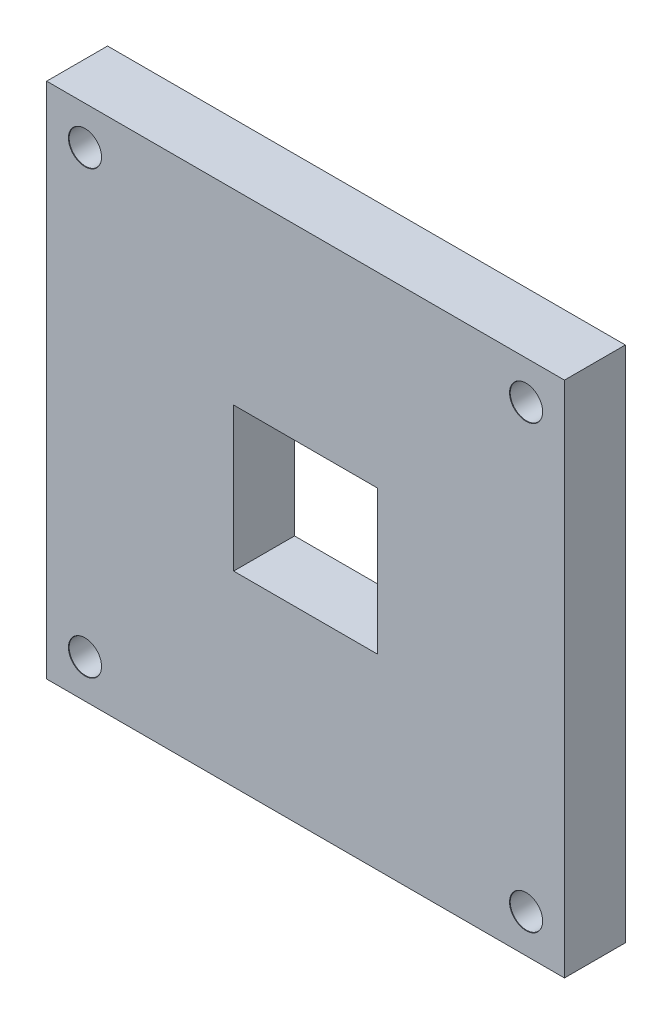
ISO-10303-21;
HEADER;
FILE_DESCRIPTION(('STEP AP214'),'2;1');
FILE_NAME('part.step','',(''),(''),'','','');
FILE_SCHEMA(('AUTOMOTIVE_DESIGN { 1 0 10303 214 1 1 1 1 }'));
ENDSEC;
DATA;
#1=APPLICATION_CONTEXT('core data for automotive mechanical design processes');
#2=APPLICATION_PROTOCOL_DEFINITION('international standard','automotive_design',2000,#1);
#3=PRODUCT_CONTEXT('',#1,'mechanical');
#4=PRODUCT('Part','Part','',(#3));
#5=PRODUCT_RELATED_PRODUCT_CATEGORY('part','',(#4));
#6=PRODUCT_DEFINITION_FORMATION('','',#4);
#7=PRODUCT_DEFINITION_CONTEXT('part definition',#1,'design');
#8=PRODUCT_DEFINITION('design','',#6,#7);
#9=PRODUCT_DEFINITION_SHAPE('','',#8);
#10=(LENGTH_UNIT() NAMED_UNIT(*) SI_UNIT(.MILLI.,.METRE.));
#11=(NAMED_UNIT(*) PLANE_ANGLE_UNIT() SI_UNIT($,.RADIAN.));
#12=(NAMED_UNIT(*) SI_UNIT($,.STERADIAN.) SOLID_ANGLE_UNIT());
#13=UNCERTAINTY_MEASURE_WITH_UNIT(LENGTH_MEASURE(1.E-05),#10,'distance_accuracy_value','');
#14=(GEOMETRIC_REPRESENTATION_CONTEXT(3) GLOBAL_UNCERTAINTY_ASSIGNED_CONTEXT((#13)) GLOBAL_UNIT_ASSIGNED_CONTEXT((#10,
#11,#12)) REPRESENTATION_CONTEXT('',''));
#15=CARTESIAN_POINT('',(0.,0.,0.));
#16=DIRECTION('',(0.,0.,1.));
#17=DIRECTION('',(1.,0.,0.));
#18=AXIS2_PLACEMENT_3D('',#15,#16,#17);
#19=CARTESIAN_POINT('',(-27.,-27.,-6.35));
#20=DIRECTION('',(0.,-1.,0.));
#21=DIRECTION('',(0.,0.,-1.));
#22=AXIS2_PLACEMENT_3D('',#19,#20,#21);
#23=PLANE('',#22);
#24=DIRECTION('',(1.,0.,0.));
#25=VECTOR('',#24,1.);
#26=CARTESIAN_POINT('',(-27.,-27.,0.));
#27=LINE('',#26,#25);
#28=CARTESIAN_POINT('',(-27.,-27.,0.));
#29=VERTEX_POINT('',#28);
#30=CARTESIAN_POINT('',(27.,-27.,0.));
#31=VERTEX_POINT('',#30);
#32=EDGE_CURVE('E186',#29,#31,#27,.T.);
#33=ORIENTED_EDGE('',*,*,#32,.F.);
#34=DIRECTION('',(0.,0.,1.));
#35=VECTOR('',#34,1.);
#36=CARTESIAN_POINT('',(-27.,-27.,-6.35));
#37=LINE('',#36,#35);
#38=CARTESIAN_POINT('',(-27.,-27.,-6.35));
#39=VERTEX_POINT('',#38);
#40=EDGE_CURVE('E11',#39,#29,#37,.T.);
#41=ORIENTED_EDGE('',*,*,#40,.F.);
#42=DIRECTION('',(1.,0.,0.));
#43=VECTOR('',#42,1.);
#44=CARTESIAN_POINT('',(-27.,-27.,-6.35));
#45=LINE('',#44,#43);
#46=CARTESIAN_POINT('',(27.,-27.,-6.35));
#47=VERTEX_POINT('',#46);
#48=EDGE_CURVE('E174',#39,#47,#45,.T.);
#49=ORIENTED_EDGE('',*,*,#48,.T.);
#50=DIRECTION('',(0.,0.,1.));
#51=VECTOR('',#50,1.);
#52=CARTESIAN_POINT('',(27.,-27.,-6.35));
#53=LINE('',#52,#51);
#54=EDGE_CURVE('E185',#47,#31,#53,.T.);
#55=ORIENTED_EDGE('',*,*,#54,.T.);
#56=EDGE_LOOP('',(#33,#41,#49,#55));
#57=FACE_BOUND('',#56,.T.);
#58=ADVANCED_FACE('F45',(#57),#23,.T.);
#59=CARTESIAN_POINT('',(-27.,-27.,-6.35));
#60=DIRECTION('',(1.,0.,0.));
#61=DIRECTION('',(0.,0.,-1.));
#62=AXIS2_PLACEMENT_3D('',#59,#60,#61);
#63=PLANE('',#62);
#64=DIRECTION('',(0.,1.,0.));
#65=VECTOR('',#64,1.);
#66=CARTESIAN_POINT('',(-27.,-27.,0.));
#67=LINE('',#66,#65);
#68=CARTESIAN_POINT('',(-27.,27.,0.));
#69=VERTEX_POINT('',#68);
#70=EDGE_CURVE('E178',#29,#69,#67,.T.);
#71=ORIENTED_EDGE('',*,*,#70,.T.);
#72=DIRECTION('',(0.,0.,1.));
#73=VECTOR('',#72,1.);
#74=CARTESIAN_POINT('',(-27.,27.,-6.35));
#75=LINE('',#74,#73);
#76=CARTESIAN_POINT('',(-27.,27.,-6.35));
#77=VERTEX_POINT('',#76);
#78=EDGE_CURVE('E53',#77,#69,#75,.T.);
#79=ORIENTED_EDGE('',*,*,#78,.F.);
#80=DIRECTION('',(0.,1.,0.));
#81=VECTOR('',#80,1.);
#82=CARTESIAN_POINT('',(-27.,-27.,-6.35));
#83=LINE('',#82,#81);
#84=EDGE_CURVE('E183',#39,#77,#83,.T.);
#85=ORIENTED_EDGE('',*,*,#84,.F.);
#86=ORIENTED_EDGE('',*,*,#40,.T.);
#87=EDGE_LOOP('',(#71,#79,#85,#86));
#88=FACE_BOUND('',#87,.T.);
#89=ADVANCED_FACE('F227',(#88),#63,.F.);
#90=CARTESIAN_POINT('',(-27.,27.,-6.35));
#91=DIRECTION('',(0.,-1.,0.));
#92=DIRECTION('',(0.,0.,-1.));
#93=AXIS2_PLACEMENT_3D('',#90,#91,#92);
#94=PLANE('',#93);
#95=DIRECTION('',(1.,0.,0.));
#96=VECTOR('',#95,1.);
#97=CARTESIAN_POINT('',(-27.,27.,0.));
#98=LINE('',#97,#96);
#99=CARTESIAN_POINT('',(27.,27.,0.));
#100=VERTEX_POINT('',#99);
#101=EDGE_CURVE('E192',#69,#100,#98,.T.);
#102=ORIENTED_EDGE('',*,*,#101,.T.);
#103=DIRECTION('',(0.,0.,1.));
#104=VECTOR('',#103,1.);
#105=CARTESIAN_POINT('',(27.,27.,-6.35));
#106=LINE('',#105,#104);
#107=CARTESIAN_POINT('',(27.,27.,-6.35));
#108=VERTEX_POINT('',#107);
#109=EDGE_CURVE('E198',#108,#100,#106,.T.);
#110=ORIENTED_EDGE('',*,*,#109,.F.);
#111=DIRECTION('',(1.,0.,0.));
#112=VECTOR('',#111,1.);
#113=CARTESIAN_POINT('',(-27.,27.,-6.35));
#114=LINE('',#113,#112);
#115=EDGE_CURVE('E181',#77,#108,#114,.T.);
#116=ORIENTED_EDGE('',*,*,#115,.F.);
#117=ORIENTED_EDGE('',*,*,#78,.T.);
#118=EDGE_LOOP('',(#102,#110,#116,#117));
#119=FACE_BOUND('',#118,.T.);
#120=ADVANCED_FACE('F232',(#119),#94,.F.);
#121=CARTESIAN_POINT('',(27.,-27.,-6.35));
#122=DIRECTION('',(1.,0.,0.));
#123=DIRECTION('',(0.,0.,-1.));
#124=AXIS2_PLACEMENT_3D('',#121,#122,#123);
#125=PLANE('',#124);
#126=DIRECTION('',(0.,1.,0.));
#127=VECTOR('',#126,1.);
#128=CARTESIAN_POINT('',(27.,-27.,0.));
#129=LINE('',#128,#127);
#130=EDGE_CURVE('E189',#31,#100,#129,.T.);
#131=ORIENTED_EDGE('',*,*,#130,.F.);
#132=ORIENTED_EDGE('',*,*,#54,.F.);
#133=DIRECTION('',(0.,1.,0.));
#134=VECTOR('',#133,1.);
#135=CARTESIAN_POINT('',(27.,-27.,-6.35));
#136=LINE('',#135,#134);
#137=EDGE_CURVE('E177',#47,#108,#136,.T.);
#138=ORIENTED_EDGE('',*,*,#137,.T.);
#139=ORIENTED_EDGE('',*,*,#109,.T.);
#140=EDGE_LOOP('',(#131,#132,#138,#139));
#141=FACE_BOUND('',#140,.T.);
#142=ADVANCED_FACE('F249',(#141),#125,.T.);
#143=CARTESIAN_POINT('',(0.,0.,-6.35));
#144=DIRECTION('',(0.,0.,1.));
#145=DIRECTION('',(1.,0.,0.));
#146=AXIS2_PLACEMENT_3D('',#143,#144,#145);
#147=PLANE('',#146);
#148=DIRECTION('',(1.,0.,0.));
#149=VECTOR('',#148,1.);
#150=CARTESIAN_POINT('',(0.,-7.5,-6.35));
#151=LINE('',#150,#149);
#152=CARTESIAN_POINT('',(-7.5,-7.5,-6.35));
#153=VERTEX_POINT('',#152);
#154=CARTESIAN_POINT('',(7.5,-7.5,-6.35));
#155=VERTEX_POINT('',#154);
#156=EDGE_CURVE('E141',#153,#155,#151,.T.);
#157=ORIENTED_EDGE('',*,*,#156,.T.);
#158=DIRECTION('',(0.,1.,0.));
#159=VECTOR('',#158,1.);
#160=CARTESIAN_POINT('',(7.5,0.,-6.35));
#161=LINE('',#160,#159);
#162=CARTESIAN_POINT('',(7.5,7.5,-6.35));
#163=VERTEX_POINT('',#162);
#164=EDGE_CURVE('E144',#155,#163,#161,.T.);
#165=ORIENTED_EDGE('',*,*,#164,.T.);
#166=DIRECTION('',(-1.,0.,0.));
#167=VECTOR('',#166,1.);
#168=CARTESIAN_POINT('',(0.,7.5,-6.35));
#169=LINE('',#168,#167);
#170=CARTESIAN_POINT('',(-7.5,7.5,-6.35));
#171=VERTEX_POINT('',#170);
#172=EDGE_CURVE('E136',#163,#171,#169,.T.);
#173=ORIENTED_EDGE('',*,*,#172,.T.);
#174=DIRECTION('',(0.,-1.,0.));
#175=VECTOR('',#174,1.);
#176=CARTESIAN_POINT('',(-7.5,0.,-6.35));
#177=LINE('',#176,#175);
#178=EDGE_CURVE('E116',#171,#153,#177,.T.);
#179=ORIENTED_EDGE('',*,*,#178,.T.);
#180=EDGE_LOOP('',(#157,#165,#173,#179));
#181=FACE_BOUND('',#180,.T.);
#182=CARTESIAN_POINT('',(23.,23.,-6.35));
#183=DIRECTION('',(0.,0.,1.));
#184=DIRECTION('',(1.,0.,0.));
#185=AXIS2_PLACEMENT_3D('',#182,#183,#184);
#186=CIRCLE('',#185,1.7);
#187=CARTESIAN_POINT('',(24.7,23.,-6.35));
#188=VERTEX_POINT('',#187);
#189=EDGE_CURVE('E48',#188,#188,#186,.T.);
#190=ORIENTED_EDGE('',*,*,#189,.T.);
#191=EDGE_LOOP('',(#190));
#192=FACE_BOUND('',#191,.T.);
#193=CARTESIAN_POINT('',(-23.,-23.,-6.35));
#194=DIRECTION('',(0.,0.,1.));
#195=DIRECTION('',(1.,0.,0.));
#196=AXIS2_PLACEMENT_3D('',#193,#194,#195);
#197=CIRCLE('',#196,1.7);
#198=CARTESIAN_POINT('',(-21.3,-23.,-6.35));
#199=VERTEX_POINT('',#198);
#200=EDGE_CURVE('E159',#199,#199,#197,.T.);
#201=ORIENTED_EDGE('',*,*,#200,.T.);
#202=EDGE_LOOP('',(#201));
#203=FACE_BOUND('',#202,.T.);
#204=CARTESIAN_POINT('',(-23.,23.,-6.35));
#205=DIRECTION('',(0.,0.,1.));
#206=DIRECTION('',(1.,0.,0.));
#207=AXIS2_PLACEMENT_3D('',#204,#205,#206);
#208=CIRCLE('',#207,1.7);
#209=CARTESIAN_POINT('',(-21.3,23.,-6.35));
#210=VERTEX_POINT('',#209);
#211=EDGE_CURVE('E166',#210,#210,#208,.T.);
#212=ORIENTED_EDGE('',*,*,#211,.T.);
#213=EDGE_LOOP('',(#212));
#214=FACE_BOUND('',#213,.T.);
#215=CARTESIAN_POINT('',(23.,-23.,-6.35));
#216=DIRECTION('',(0.,0.,1.));
#217=DIRECTION('',(1.,0.,0.));
#218=AXIS2_PLACEMENT_3D('',#215,#216,#217);
#219=CIRCLE('',#218,1.7);
#220=CARTESIAN_POINT('',(24.7,-23.,-6.35));
#221=VERTEX_POINT('',#220);
#222=EDGE_CURVE('E173',#221,#221,#219,.T.);
#223=ORIENTED_EDGE('',*,*,#222,.T.);
#224=EDGE_LOOP('',(#223));
#225=FACE_BOUND('',#224,.T.);
#226=ORIENTED_EDGE('',*,*,#48,.F.);
#227=ORIENTED_EDGE('',*,*,#84,.T.);
#228=ORIENTED_EDGE('',*,*,#115,.T.);
#229=ORIENTED_EDGE('',*,*,#137,.F.);
#230=EDGE_LOOP('',(#226,#227,#228,#229));
#231=FACE_BOUND('',#230,.T.);
#232=ADVANCED_FACE('F207',(#181,#192,#203,#214,#225,#231),#147,.F.);
#233=CARTESIAN_POINT('',(0.,0.,0.));
#234=DIRECTION('',(0.,0.,1.));
#235=DIRECTION('',(1.,0.,0.));
#236=AXIS2_PLACEMENT_3D('',#233,#234,#235);
#237=PLANE('',#236);
#238=DIRECTION('',(0.,1.,0.));
#239=VECTOR('',#238,1.);
#240=CARTESIAN_POINT('',(7.5,7.5,0.));
#241=LINE('',#240,#239);
#242=CARTESIAN_POINT('',(7.5,-7.5,0.));
#243=VERTEX_POINT('',#242);
#244=CARTESIAN_POINT('',(7.5,7.5,0.));
#245=VERTEX_POINT('',#244);
#246=EDGE_CURVE('E69',#243,#245,#241,.T.);
#247=ORIENTED_EDGE('',*,*,#246,.F.);
#248=DIRECTION('',(1.,0.,0.));
#249=VECTOR('',#248,1.);
#250=CARTESIAN_POINT('',(-7.5,-7.5,0.));
#251=LINE('',#250,#249);
#252=CARTESIAN_POINT('',(-7.5,-7.5,0.));
#253=VERTEX_POINT('',#252);
#254=EDGE_CURVE('E129',#253,#243,#251,.T.);
#255=ORIENTED_EDGE('',*,*,#254,.F.);
#256=DIRECTION('',(0.,-1.,0.));
#257=VECTOR('',#256,1.);
#258=CARTESIAN_POINT('',(-7.5,7.5,0.));
#259=LINE('',#258,#257);
#260=CARTESIAN_POINT('',(-7.5,7.5,0.));
#261=VERTEX_POINT('',#260);
#262=EDGE_CURVE('E113',#261,#253,#259,.T.);
#263=ORIENTED_EDGE('',*,*,#262,.F.);
#264=DIRECTION('',(-1.,0.,0.));
#265=VECTOR('',#264,1.);
#266=CARTESIAN_POINT('',(-7.5,7.5,0.));
#267=LINE('',#266,#265);
#268=EDGE_CURVE('E122',#245,#261,#267,.T.);
#269=ORIENTED_EDGE('',*,*,#268,.F.);
#270=EDGE_LOOP('',(#247,#255,#263,#269));
#271=FACE_BOUND('',#270,.T.);
#272=CARTESIAN_POINT('',(23.,23.,0.));
#273=DIRECTION('',(0.,0.,1.));
#274=DIRECTION('',(1.,0.,0.));
#275=AXIS2_PLACEMENT_3D('',#272,#273,#274);
#276=CIRCLE('',#275,1.725);
#277=CARTESIAN_POINT('',(24.725,23.,0.));
#278=VERTEX_POINT('',#277);
#279=EDGE_CURVE('E147',#278,#278,#276,.T.);
#280=ORIENTED_EDGE('',*,*,#279,.F.);
#281=EDGE_LOOP('',(#280));
#282=FACE_BOUND('',#281,.T.);
#283=CARTESIAN_POINT('',(-23.,-23.,0.));
#284=DIRECTION('',(0.,0.,1.));
#285=DIRECTION('',(1.,0.,0.));
#286=AXIS2_PLACEMENT_3D('',#283,#284,#285);
#287=CIRCLE('',#286,1.725);
#288=CARTESIAN_POINT('',(-21.275,-23.,0.));
#289=VERTEX_POINT('',#288);
#290=EDGE_CURVE('E153',#289,#289,#287,.T.);
#291=ORIENTED_EDGE('',*,*,#290,.F.);
#292=EDGE_LOOP('',(#291));
#293=FACE_BOUND('',#292,.T.);
#294=CARTESIAN_POINT('',(-23.,23.,0.));
#295=DIRECTION('',(0.,0.,1.));
#296=DIRECTION('',(1.,0.,0.));
#297=AXIS2_PLACEMENT_3D('',#294,#295,#296);
#298=CIRCLE('',#297,1.725);
#299=CARTESIAN_POINT('',(-21.275,23.,0.));
#300=VERTEX_POINT('',#299);
#301=EDGE_CURVE('E160',#300,#300,#298,.T.);
#302=ORIENTED_EDGE('',*,*,#301,.F.);
#303=EDGE_LOOP('',(#302));
#304=FACE_BOUND('',#303,.T.);
#305=CARTESIAN_POINT('',(23.,-23.,0.));
#306=DIRECTION('',(0.,0.,1.));
#307=DIRECTION('',(1.,0.,0.));
#308=AXIS2_PLACEMENT_3D('',#305,#306,#307);
#309=CIRCLE('',#308,1.725);
#310=CARTESIAN_POINT('',(24.725,-23.,0.));
#311=VERTEX_POINT('',#310);
#312=EDGE_CURVE('E167',#311,#311,#309,.T.);
#313=ORIENTED_EDGE('',*,*,#312,.F.);
#314=EDGE_LOOP('',(#313));
#315=FACE_BOUND('',#314,.T.);
#316=ORIENTED_EDGE('',*,*,#32,.T.);
#317=ORIENTED_EDGE('',*,*,#130,.T.);
#318=ORIENTED_EDGE('',*,*,#101,.F.);
#319=ORIENTED_EDGE('',*,*,#70,.F.);
#320=EDGE_LOOP('',(#316,#317,#318,#319));
#321=FACE_BOUND('',#320,.T.);
#322=ADVANCED_FACE('F126',(#271,#282,#293,#304,#315,#321),#237,.T.);
#323=CARTESIAN_POINT('',(23.,-23.,0.));
#324=DIRECTION('',(0.,0.,1.));
#325=DIRECTION('',(1.,0.,0.));
#326=AXIS2_PLACEMENT_3D('',#323,#324,#325);
#327=CYLINDRICAL_SURFACE('',#326,1.7);
#328=CARTESIAN_POINT('',(23.,-23.,-0.0433012701892242));
#329=DIRECTION('',(0.,0.,1.));
#330=DIRECTION('',(1.,0.,0.));
#331=AXIS2_PLACEMENT_3D('',#328,#329,#330);
#332=CIRCLE('',#331,1.7);
#333=CARTESIAN_POINT('',(24.7,-23.,-0.0433012701892242));
#334=VERTEX_POINT('',#333);
#335=EDGE_CURVE('E170',#334,#334,#332,.T.);
#336=ORIENTED_EDGE('',*,*,#335,.T.);
#337=EDGE_LOOP('',(#336));
#338=FACE_BOUND('',#337,.T.);
#339=ORIENTED_EDGE('',*,*,#222,.F.);
#340=EDGE_LOOP('',(#339));
#341=FACE_BOUND('',#340,.T.);
#342=ADVANCED_FACE('F261',(#338,#341),#327,.F.);
#343=CARTESIAN_POINT('',(23.,-23.,0.));
#344=DIRECTION('',(0.,0.,1.));
#345=DIRECTION('',(1.,0.,0.));
#346=AXIS2_PLACEMENT_3D('',#343,#344,#345);
#347=CONICAL_SURFACE('',#346,1.725,0.523598775598288);
#348=ORIENTED_EDGE('',*,*,#335,.F.);
#349=EDGE_LOOP('',(#348));
#350=FACE_BOUND('',#349,.T.);
#351=ORIENTED_EDGE('',*,*,#312,.T.);
#352=EDGE_LOOP('',(#351));
#353=FACE_BOUND('',#352,.T.);
#354=ADVANCED_FACE('F264',(#350,#353),#347,.F.);
#355=CARTESIAN_POINT('',(-23.,23.,0.));
#356=DIRECTION('',(0.,0.,1.));
#357=DIRECTION('',(1.,0.,0.));
#358=AXIS2_PLACEMENT_3D('',#355,#356,#357);
#359=CYLINDRICAL_SURFACE('',#358,1.7);
#360=CARTESIAN_POINT('',(-23.,23.,-0.0433012701892242));
#361=DIRECTION('',(0.,0.,1.));
#362=DIRECTION('',(1.,0.,0.));
#363=AXIS2_PLACEMENT_3D('',#360,#361,#362);
#364=CIRCLE('',#363,1.7);
#365=CARTESIAN_POINT('',(-21.3,23.,-0.0433012701892242));
#366=VERTEX_POINT('',#365);
#367=EDGE_CURVE('E163',#366,#366,#364,.T.);
#368=ORIENTED_EDGE('',*,*,#367,.T.);
#369=EDGE_LOOP('',(#368));
#370=FACE_BOUND('',#369,.T.);
#371=ORIENTED_EDGE('',*,*,#211,.F.);
#372=EDGE_LOOP('',(#371));
#373=FACE_BOUND('',#372,.T.);
#374=ADVANCED_FACE('F223',(#370,#373),#359,.F.);
#375=CARTESIAN_POINT('',(-23.,23.,0.));
#376=DIRECTION('',(0.,0.,1.));
#377=DIRECTION('',(1.,0.,0.));
#378=AXIS2_PLACEMENT_3D('',#375,#376,#377);
#379=CONICAL_SURFACE('',#378,1.725,0.523598775598288);
#380=ORIENTED_EDGE('',*,*,#367,.F.);
#381=EDGE_LOOP('',(#380));
#382=FACE_BOUND('',#381,.T.);
#383=ORIENTED_EDGE('',*,*,#301,.T.);
#384=EDGE_LOOP('',(#383));
#385=FACE_BOUND('',#384,.T.);
#386=ADVANCED_FACE('F213',(#382,#385),#379,.F.);
#387=CARTESIAN_POINT('',(-23.,-23.,0.));
#388=DIRECTION('',(0.,0.,1.));
#389=DIRECTION('',(1.,0.,0.));
#390=AXIS2_PLACEMENT_3D('',#387,#388,#389);
#391=CYLINDRICAL_SURFACE('',#390,1.7);
#392=CARTESIAN_POINT('',(-23.,-23.,-0.0433012701892242));
#393=DIRECTION('',(0.,0.,1.));
#394=DIRECTION('',(1.,0.,0.));
#395=AXIS2_PLACEMENT_3D('',#392,#393,#394);
#396=CIRCLE('',#395,1.7);
#397=CARTESIAN_POINT('',(-21.3,-23.,-0.0433012701892242));
#398=VERTEX_POINT('',#397);
#399=EDGE_CURVE('E156',#398,#398,#396,.T.);
#400=ORIENTED_EDGE('',*,*,#399,.T.);
#401=EDGE_LOOP('',(#400));
#402=FACE_BOUND('',#401,.T.);
#403=ORIENTED_EDGE('',*,*,#200,.F.);
#404=EDGE_LOOP('',(#403));
#405=FACE_BOUND('',#404,.T.);
#406=ADVANCED_FACE('F210',(#402,#405),#391,.F.);
#407=CARTESIAN_POINT('',(-23.,-23.,0.));
#408=DIRECTION('',(0.,0.,1.));
#409=DIRECTION('',(1.,0.,0.));
#410=AXIS2_PLACEMENT_3D('',#407,#408,#409);
#411=CONICAL_SURFACE('',#410,1.725,0.523598775598288);
#412=ORIENTED_EDGE('',*,*,#399,.F.);
#413=EDGE_LOOP('',(#412));
#414=FACE_BOUND('',#413,.T.);
#415=ORIENTED_EDGE('',*,*,#290,.T.);
#416=EDGE_LOOP('',(#415));
#417=FACE_BOUND('',#416,.T.);
#418=ADVANCED_FACE('F212',(#414,#417),#411,.F.);
#419=CARTESIAN_POINT('',(23.,23.,0.));
#420=DIRECTION('',(0.,0.,1.));
#421=DIRECTION('',(1.,0.,0.));
#422=AXIS2_PLACEMENT_3D('',#419,#420,#421);
#423=CYLINDRICAL_SURFACE('',#422,1.7);
#424=CARTESIAN_POINT('',(23.,23.,-0.0433012701892242));
#425=DIRECTION('',(0.,0.,1.));
#426=DIRECTION('',(1.,0.,0.));
#427=AXIS2_PLACEMENT_3D('',#424,#425,#426);
#428=CIRCLE('',#427,1.7);
#429=CARTESIAN_POINT('',(24.7,23.,-0.0433012701892242));
#430=VERTEX_POINT('',#429);
#431=EDGE_CURVE('E150',#430,#430,#428,.T.);
#432=ORIENTED_EDGE('',*,*,#431,.T.);
#433=EDGE_LOOP('',(#432));
#434=FACE_BOUND('',#433,.T.);
#435=ORIENTED_EDGE('',*,*,#189,.F.);
#436=EDGE_LOOP('',(#435));
#437=FACE_BOUND('',#436,.T.);
#438=ADVANCED_FACE('F220',(#434,#437),#423,.F.);
#439=CARTESIAN_POINT('',(23.,23.,0.));
#440=DIRECTION('',(0.,0.,1.));
#441=DIRECTION('',(1.,0.,0.));
#442=AXIS2_PLACEMENT_3D('',#439,#440,#441);
#443=CONICAL_SURFACE('',#442,1.725,0.523598775598288);
#444=ORIENTED_EDGE('',*,*,#431,.F.);
#445=EDGE_LOOP('',(#444));
#446=FACE_BOUND('',#445,.T.);
#447=ORIENTED_EDGE('',*,*,#279,.T.);
#448=EDGE_LOOP('',(#447));
#449=FACE_BOUND('',#448,.T.);
#450=ADVANCED_FACE('F312',(#446,#449),#443,.F.);
#451=CARTESIAN_POINT('',(7.5,7.5,-10.));
#452=DIRECTION('',(1.,0.,0.));
#453=DIRECTION('',(0.,1.,0.));
#454=AXIS2_PLACEMENT_3D('',#451,#452,#453);
#455=PLANE('',#454);
#456=DIRECTION('',(0.,0.,1.));
#457=VECTOR('',#456,1.);
#458=CARTESIAN_POINT('',(7.5,-7.5,-10.));
#459=LINE('',#458,#457);
#460=EDGE_CURVE('E134',#155,#243,#459,.T.);
#461=ORIENTED_EDGE('',*,*,#460,.T.);
#462=ORIENTED_EDGE('',*,*,#246,.T.);
#463=DIRECTION('',(0.,0.,1.));
#464=VECTOR('',#463,1.);
#465=CARTESIAN_POINT('',(7.5,7.5,-10.));
#466=LINE('',#465,#464);
#467=EDGE_CURVE('E119',#163,#245,#466,.T.);
#468=ORIENTED_EDGE('',*,*,#467,.F.);
#469=ORIENTED_EDGE('',*,*,#164,.F.);
#470=EDGE_LOOP('',(#461,#462,#468,#469));
#471=FACE_BOUND('',#470,.T.);
#472=ADVANCED_FACE('F322',(#471),#455,.F.);
#473=CARTESIAN_POINT('',(-7.5,-7.5,-10.));
#474=DIRECTION('',(0.,-1.,0.));
#475=DIRECTION('',(0.,0.,-1.));
#476=AXIS2_PLACEMENT_3D('',#473,#474,#475);
#477=PLANE('',#476);
#478=DIRECTION('',(0.,0.,1.));
#479=VECTOR('',#478,1.);
#480=CARTESIAN_POINT('',(-7.5,-7.5,-10.));
#481=LINE('',#480,#479);
#482=EDGE_CURVE('E118',#153,#253,#481,.T.);
#483=ORIENTED_EDGE('',*,*,#482,.T.);
#484=ORIENTED_EDGE('',*,*,#254,.T.);
#485=ORIENTED_EDGE('',*,*,#460,.F.);
#486=ORIENTED_EDGE('',*,*,#156,.F.);
#487=EDGE_LOOP('',(#483,#484,#485,#486));
#488=FACE_BOUND('',#487,.T.);
#489=ADVANCED_FACE('F332',(#488),#477,.F.);
#490=CARTESIAN_POINT('',(-7.5,7.5,-10.));
#491=DIRECTION('',(-1.,0.,0.));
#492=DIRECTION('',(0.,-1.,0.));
#493=AXIS2_PLACEMENT_3D('',#490,#491,#492);
#494=PLANE('',#493);
#495=DIRECTION('',(0.,0.,1.));
#496=VECTOR('',#495,1.);
#497=CARTESIAN_POINT('',(-7.5,7.5,-10.));
#498=LINE('',#497,#496);
#499=EDGE_CURVE('E61',#171,#261,#498,.T.);
#500=ORIENTED_EDGE('',*,*,#499,.T.);
#501=ORIENTED_EDGE('',*,*,#262,.T.);
#502=ORIENTED_EDGE('',*,*,#482,.F.);
#503=ORIENTED_EDGE('',*,*,#178,.F.);
#504=EDGE_LOOP('',(#500,#501,#502,#503));
#505=FACE_BOUND('',#504,.T.);
#506=ADVANCED_FACE('F110',(#505),#494,.F.);
#507=CARTESIAN_POINT('',(-7.5,7.5,-10.));
#508=DIRECTION('',(0.,1.,0.));
#509=DIRECTION('',(0.,0.,1.));
#510=AXIS2_PLACEMENT_3D('',#507,#508,#509);
#511=PLANE('',#510);
#512=ORIENTED_EDGE('',*,*,#467,.T.);
#513=ORIENTED_EDGE('',*,*,#268,.T.);
#514=ORIENTED_EDGE('',*,*,#499,.F.);
#515=ORIENTED_EDGE('',*,*,#172,.F.);
#516=EDGE_LOOP('',(#512,#513,#514,#515));
#517=FACE_BOUND('',#516,.T.);
#518=ADVANCED_FACE('F123',(#517),#511,.F.);
#519=CLOSED_SHELL('',(#58,#89,#120,#142,#232,#322,#342,#354,#374,#386,#406,#418,#438,#450,#472,
#489,#506,#518));
#520=MANIFOLD_SOLID_BREP('B2',#519);
#521=ADVANCED_BREP_SHAPE_REPRESENTATION('',(#18,#520),#14);
#522=SHAPE_DEFINITION_REPRESENTATION(#9,#521);
ENDSEC;
END-ISO-10303-21;
